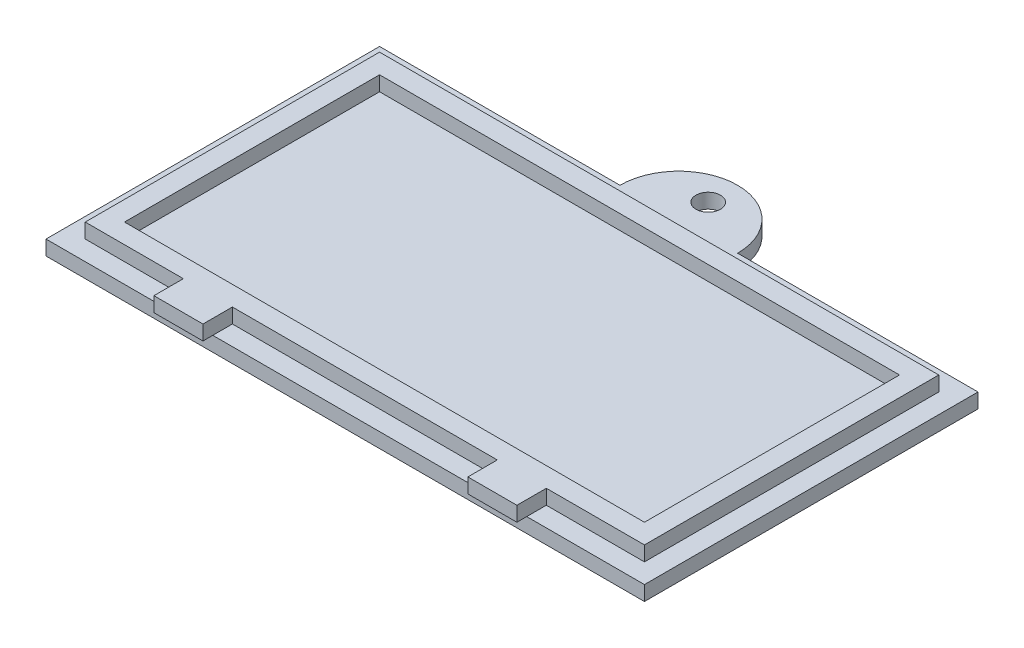
ISO-10303-21;
HEADER;
FILE_DESCRIPTION(('STEP AP214'),'2;1');
FILE_NAME('part.step','',(''),(''),'','','');
FILE_SCHEMA(('AUTOMOTIVE_DESIGN { 1 0 10303 214 1 1 1 1 }'));
ENDSEC;
DATA;
#1=APPLICATION_CONTEXT('core data for automotive mechanical design processes');
#2=APPLICATION_PROTOCOL_DEFINITION('international standard','automotive_design',2000,#1);
#3=PRODUCT_CONTEXT('',#1,'mechanical');
#4=PRODUCT('Part','Part','',(#3));
#5=PRODUCT_RELATED_PRODUCT_CATEGORY('part','',(#4));
#6=PRODUCT_DEFINITION_FORMATION('','',#4);
#7=PRODUCT_DEFINITION_CONTEXT('part definition',#1,'design');
#8=PRODUCT_DEFINITION('design','',#6,#7);
#9=PRODUCT_DEFINITION_SHAPE('','',#8);
#10=(LENGTH_UNIT() NAMED_UNIT(*) SI_UNIT(.MILLI.,.METRE.));
#11=(NAMED_UNIT(*) PLANE_ANGLE_UNIT() SI_UNIT($,.RADIAN.));
#12=(NAMED_UNIT(*) SI_UNIT($,.STERADIAN.) SOLID_ANGLE_UNIT());
#13=UNCERTAINTY_MEASURE_WITH_UNIT(LENGTH_MEASURE(1.E-05),#10,'distance_accuracy_value','');
#14=(GEOMETRIC_REPRESENTATION_CONTEXT(3) GLOBAL_UNCERTAINTY_ASSIGNED_CONTEXT((#13)) GLOBAL_UNIT_ASSIGNED_CONTEXT((#10,
#11,#12)) REPRESENTATION_CONTEXT('',''));
#15=CARTESIAN_POINT('',(0.,0.,0.));
#16=DIRECTION('',(0.,0.,1.));
#17=DIRECTION('',(1.,0.,0.));
#18=AXIS2_PLACEMENT_3D('',#15,#16,#17);
#19=CARTESIAN_POINT('',(0.,1.5,0.));
#20=DIRECTION('',(0.,-1.,0.));
#21=DIRECTION('',(0.,0.,-1.));
#22=AXIS2_PLACEMENT_3D('',#19,#20,#21);
#23=PLANE('',#22);
#24=DIRECTION('',(0.,0.,-1.));
#25=VECTOR('',#24,1.);
#26=CARTESIAN_POINT('',(44.,1.5,1.));
#27=LINE('',#26,#25);
#28=CARTESIAN_POINT('',(44.,1.5,0.));
#29=VERTEX_POINT('',#28);
#30=CARTESIAN_POINT('',(44.,1.5,-2.));
#31=VERTEX_POINT('',#30);
#32=EDGE_CURVE('E427',#29,#31,#27,.T.);
#33=ORIENTED_EDGE('',*,*,#32,.T.);
#34=DIRECTION('',(1.,0.,0.));
#35=VECTOR('',#34,1.);
#36=CARTESIAN_POINT('',(2.,1.5,-2.));
#37=LINE('',#36,#35);
#38=CARTESIAN_POINT('',(17.,1.5,-2.));
#39=VERTEX_POINT('',#38);
#40=EDGE_CURVE('E221',#39,#31,#37,.T.);
#41=ORIENTED_EDGE('',*,*,#40,.F.);
#42=DIRECTION('',(0.,0.,-1.));
#43=VECTOR('',#42,1.);
#44=CARTESIAN_POINT('',(17.,1.5,1.));
#45=LINE('',#44,#43);
#46=CARTESIAN_POINT('',(17.,1.5,0.));
#47=VERTEX_POINT('',#46);
#48=EDGE_CURVE('E428',#47,#39,#45,.T.);
#49=ORIENTED_EDGE('',*,*,#48,.F.);
#50=DIRECTION('',(1.,0.,0.));
#51=VECTOR('',#50,1.);
#52=CARTESIAN_POINT('',(0.,1.5,0.));
#53=LINE('',#52,#51);
#54=EDGE_CURVE('E274',#47,#29,#53,.T.);
#55=ORIENTED_EDGE('',*,*,#54,.T.);
#56=EDGE_LOOP('',(#33,#41,#49,#55));
#57=FACE_BOUND('',#56,.T.);
#58=ADVANCED_FACE('F41',(#57),#23,.F.);
#59=CARTESIAN_POINT('',(30.5,1.5,-37.));
#60=DIRECTION('',(0.,-1.,0.));
#61=DIRECTION('',(0.,0.,-1.));
#62=AXIS2_PLACEMENT_3D('',#59,#60,#61);
#63=CIRCLE('',#62,1.24999999999999);
#64=CARTESIAN_POINT('',(30.5,1.5,-38.25));
#65=VERTEX_POINT('',#64);
#66=EDGE_CURVE('E492',#65,#65,#63,.T.);
#67=ORIENTED_EDGE('',*,*,#66,.T.);
#68=EDGE_LOOP('',(#67));
#69=FACE_BOUND('',#68,.T.);
#70=DIRECTION('',(0.,0.,-1.));
#71=VECTOR('',#70,1.);
#72=CARTESIAN_POINT('',(49.,1.5,1.));
#73=LINE('',#72,#71);
#74=CARTESIAN_POINT('',(49.,1.5,0.));
#75=VERTEX_POINT('',#74);
#76=CARTESIAN_POINT('',(49.,1.5,-2.));
#77=VERTEX_POINT('',#76);
#78=EDGE_CURVE('E417',#75,#77,#73,.T.);
#79=ORIENTED_EDGE('',*,*,#78,.F.);
#80=CARTESIAN_POINT('',(61.,1.5,0.));
#81=VERTEX_POINT('',#80);
#82=EDGE_CURVE('E268',#75,#81,#53,.T.);
#83=ORIENTED_EDGE('',*,*,#82,.T.);
#84=DIRECTION('',(0.,0.,-1.));
#85=VECTOR('',#84,1.);
#86=CARTESIAN_POINT('',(61.,1.5,0.));
#87=LINE('',#86,#85);
#88=CARTESIAN_POINT('',(61.,1.5,-34.));
#89=VERTEX_POINT('',#88);
#90=EDGE_CURVE('E273',#81,#89,#87,.T.);
#91=ORIENTED_EDGE('',*,*,#90,.T.);
#92=DIRECTION('',(-1.,0.,0.));
#93=VECTOR('',#92,1.);
#94=CARTESIAN_POINT('',(0.,1.5,-34.));
#95=LINE('',#94,#93);
#96=CARTESIAN_POINT('',(36.5,1.5,-34.));
#97=VERTEX_POINT('',#96);
#98=EDGE_CURVE('E277',#89,#97,#95,.T.);
#99=ORIENTED_EDGE('',*,*,#98,.T.);
#100=CARTESIAN_POINT('',(30.5,1.5,-34.));
#101=DIRECTION('',(0.,-1.,0.));
#102=DIRECTION('',(0.,0.,-1.));
#103=AXIS2_PLACEMENT_3D('',#100,#101,#102);
#104=CIRCLE('',#103,6.);
#105=CARTESIAN_POINT('',(24.5,1.5,-34.));
#106=VERTEX_POINT('',#105);
#107=EDGE_CURVE('E319',#106,#97,#104,.T.);
#108=ORIENTED_EDGE('',*,*,#107,.F.);
#109=CARTESIAN_POINT('',(0.,1.5,-34.));
#110=VERTEX_POINT('',#109);
#111=EDGE_CURVE('E276',#106,#110,#95,.T.);
#112=ORIENTED_EDGE('',*,*,#111,.T.);
#113=DIRECTION('',(0.,0.,1.));
#114=VECTOR('',#113,1.);
#115=CARTESIAN_POINT('',(0.,1.5,0.));
#116=LINE('',#115,#114);
#117=CARTESIAN_POINT('',(0.,1.5,0.));
#118=VERTEX_POINT('',#117);
#119=EDGE_CURVE('E265',#110,#118,#116,.T.);
#120=ORIENTED_EDGE('',*,*,#119,.T.);
#121=CARTESIAN_POINT('',(12.,1.5,0.));
#122=VERTEX_POINT('',#121);
#123=EDGE_CURVE('E270',#118,#122,#53,.T.);
#124=ORIENTED_EDGE('',*,*,#123,.T.);
#125=DIRECTION('',(0.,0.,-1.));
#126=VECTOR('',#125,1.);
#127=CARTESIAN_POINT('',(12.,1.5,1.));
#128=LINE('',#127,#126);
#129=CARTESIAN_POINT('',(12.,1.5,-2.));
#130=VERTEX_POINT('',#129);
#131=EDGE_CURVE('E438',#122,#130,#128,.T.);
#132=ORIENTED_EDGE('',*,*,#131,.T.);
#133=CARTESIAN_POINT('',(2.,1.5,-2.));
#134=VERTEX_POINT('',#133);
#135=EDGE_CURVE('E245',#134,#130,#37,.T.);
#136=ORIENTED_EDGE('',*,*,#135,.F.);
#137=DIRECTION('',(0.,0.,1.));
#138=VECTOR('',#137,1.);
#139=CARTESIAN_POINT('',(2.,1.5,-32.));
#140=LINE('',#139,#138);
#141=CARTESIAN_POINT('',(2.,1.5,-32.));
#142=VERTEX_POINT('',#141);
#143=EDGE_CURVE('E240',#142,#134,#140,.T.);
#144=ORIENTED_EDGE('',*,*,#143,.F.);
#145=DIRECTION('',(-1.,0.,0.));
#146=VECTOR('',#145,1.);
#147=CARTESIAN_POINT('',(2.,1.5,-32.));
#148=LINE('',#147,#146);
#149=CARTESIAN_POINT('',(59.,1.5,-32.));
#150=VERTEX_POINT('',#149);
#151=EDGE_CURVE('E251',#150,#142,#148,.T.);
#152=ORIENTED_EDGE('',*,*,#151,.F.);
#153=DIRECTION('',(0.,0.,-1.));
#154=VECTOR('',#153,1.);
#155=CARTESIAN_POINT('',(59.,1.5,-32.));
#156=LINE('',#155,#154);
#157=CARTESIAN_POINT('',(59.,1.5,-2.));
#158=VERTEX_POINT('',#157);
#159=EDGE_CURVE('E248',#158,#150,#156,.T.);
#160=ORIENTED_EDGE('',*,*,#159,.F.);
#161=EDGE_CURVE('E243',#77,#158,#37,.T.);
#162=ORIENTED_EDGE('',*,*,#161,.F.);
#163=EDGE_LOOP('',(#79,#83,#91,#99,#108,#112,#120,#124,#132,#136,#144,#152,#160,#162));
#164=FACE_BOUND('',#163,.T.);
#165=ADVANCED_FACE('F385',(#69,#164),#23,.F.);
#166=CARTESIAN_POINT('',(2.,3.,-2.));
#167=DIRECTION('',(0.,0.,-1.));
#168=DIRECTION('',(-1.,0.,0.));
#169=AXIS2_PLACEMENT_3D('',#166,#167,#168);
#170=PLANE('',#169);
#171=DIRECTION('',(0.,-1.,0.));
#172=VECTOR('',#171,1.);
#173=CARTESIAN_POINT('',(44.,3.,-2.));
#174=LINE('',#173,#172);
#175=CARTESIAN_POINT('',(44.,3.,-2.));
#176=VERTEX_POINT('',#175);
#177=EDGE_CURVE('E207',#176,#31,#174,.T.);
#178=ORIENTED_EDGE('',*,*,#177,.F.);
#179=DIRECTION('',(1.,0.,0.));
#180=VECTOR('',#179,1.);
#181=CARTESIAN_POINT('',(2.,3.,-2.));
#182=LINE('',#181,#180);
#183=CARTESIAN_POINT('',(17.,3.,-2.));
#184=VERTEX_POINT('',#183);
#185=EDGE_CURVE('E219',#184,#176,#182,.T.);
#186=ORIENTED_EDGE('',*,*,#185,.F.);
#187=DIRECTION('',(0.,1.,0.));
#188=VECTOR('',#187,1.);
#189=CARTESIAN_POINT('',(17.,3.,-2.));
#190=LINE('',#189,#188);
#191=EDGE_CURVE('E478',#39,#184,#190,.T.);
#192=ORIENTED_EDGE('',*,*,#191,.F.);
#193=ORIENTED_EDGE('',*,*,#40,.T.);
#194=EDGE_LOOP('',(#178,#186,#192,#193));
#195=FACE_BOUND('',#194,.T.);
#196=ADVANCED_FACE('F217',(#195),#170,.F.);
#197=DIRECTION('',(0.,1.,0.));
#198=VECTOR('',#197,1.);
#199=CARTESIAN_POINT('',(49.,3.,-2.));
#200=LINE('',#199,#198);
#201=CARTESIAN_POINT('',(49.,3.,-2.));
#202=VERTEX_POINT('',#201);
#203=EDGE_CURVE('E223',#77,#202,#200,.T.);
#204=ORIENTED_EDGE('',*,*,#203,.F.);
#205=ORIENTED_EDGE('',*,*,#161,.T.);
#206=DIRECTION('',(0.,-1.,0.));
#207=VECTOR('',#206,1.);
#208=CARTESIAN_POINT('',(59.,3.,-2.));
#209=LINE('',#208,#207);
#210=CARTESIAN_POINT('',(59.,3.,-2.));
#211=VERTEX_POINT('',#210);
#212=EDGE_CURVE('E258',#211,#158,#209,.T.);
#213=ORIENTED_EDGE('',*,*,#212,.F.);
#214=EDGE_CURVE('E228',#202,#211,#182,.T.);
#215=ORIENTED_EDGE('',*,*,#214,.F.);
#216=EDGE_LOOP('',(#204,#205,#213,#215));
#217=FACE_BOUND('',#216,.T.);
#218=ADVANCED_FACE('F463',(#217),#170,.F.);
#219=DIRECTION('',(0.,-1.,0.));
#220=VECTOR('',#219,1.);
#221=CARTESIAN_POINT('',(12.,3.,-2.));
#222=LINE('',#221,#220);
#223=CARTESIAN_POINT('',(12.,3.,-2.));
#224=VERTEX_POINT('',#223);
#225=EDGE_CURVE('E222',#224,#130,#222,.T.);
#226=ORIENTED_EDGE('',*,*,#225,.F.);
#227=CARTESIAN_POINT('',(2.,3.,-2.));
#228=VERTEX_POINT('',#227);
#229=EDGE_CURVE('E227',#228,#224,#182,.T.);
#230=ORIENTED_EDGE('',*,*,#229,.F.);
#231=DIRECTION('',(0.,-1.,0.));
#232=VECTOR('',#231,1.);
#233=CARTESIAN_POINT('',(2.,3.,-2.));
#234=LINE('',#233,#232);
#235=EDGE_CURVE('E261',#228,#134,#234,.T.);
#236=ORIENTED_EDGE('',*,*,#235,.T.);
#237=ORIENTED_EDGE('',*,*,#135,.T.);
#238=EDGE_LOOP('',(#226,#230,#236,#237));
#239=FACE_BOUND('',#238,.T.);
#240=ADVANCED_FACE('F446',(#239),#170,.F.);
#241=CARTESIAN_POINT('',(0.,1.5,-34.));
#242=DIRECTION('',(0.,0.,1.));
#243=DIRECTION('',(1.,0.,0.));
#244=AXIS2_PLACEMENT_3D('',#241,#242,#243);
#245=PLANE('',#244);
#246=ORIENTED_EDGE('',*,*,#111,.F.);
#247=DIRECTION('',(0.,-1.,0.));
#248=VECTOR('',#247,1.);
#249=CARTESIAN_POINT('',(24.5,1.5,-34.));
#250=LINE('',#249,#248);
#251=CARTESIAN_POINT('',(24.5,0.,-34.));
#252=VERTEX_POINT('',#251);
#253=EDGE_CURVE('E320',#106,#252,#250,.T.);
#254=ORIENTED_EDGE('',*,*,#253,.T.);
#255=DIRECTION('',(-1.,0.,0.));
#256=VECTOR('',#255,1.);
#257=CARTESIAN_POINT('',(0.,0.,-34.));
#258=LINE('',#257,#256);
#259=CARTESIAN_POINT('',(0.,0.,-34.));
#260=VERTEX_POINT('',#259);
#261=EDGE_CURVE('E287',#252,#260,#258,.T.);
#262=ORIENTED_EDGE('',*,*,#261,.T.);
#263=DIRECTION('',(0.,-1.,0.));
#264=VECTOR('',#263,1.);
#265=CARTESIAN_POINT('',(0.,1.5,-34.));
#266=LINE('',#265,#264);
#267=EDGE_CURVE('E280',#110,#260,#266,.T.);
#268=ORIENTED_EDGE('',*,*,#267,.F.);
#269=EDGE_LOOP('',(#246,#254,#262,#268));
#270=FACE_BOUND('',#269,.T.);
#271=ADVANCED_FACE('F401',(#270),#245,.F.);
#272=CARTESIAN_POINT('',(0.,1.5,0.));
#273=DIRECTION('',(1.,0.,0.));
#274=DIRECTION('',(0.,0.,-1.));
#275=AXIS2_PLACEMENT_3D('',#272,#273,#274);
#276=PLANE('',#275);
#277=DIRECTION('',(0.,0.,1.));
#278=VECTOR('',#277,1.);
#279=CARTESIAN_POINT('',(0.,0.,0.));
#280=LINE('',#279,#278);
#281=CARTESIAN_POINT('',(0.,0.,0.));
#282=VERTEX_POINT('',#281);
#283=EDGE_CURVE('E264',#260,#282,#280,.T.);
#284=ORIENTED_EDGE('',*,*,#283,.T.);
#285=DIRECTION('',(0.,-1.,0.));
#286=VECTOR('',#285,1.);
#287=CARTESIAN_POINT('',(0.,1.5,0.));
#288=LINE('',#287,#286);
#289=EDGE_CURVE('E11',#118,#282,#288,.T.);
#290=ORIENTED_EDGE('',*,*,#289,.F.);
#291=ORIENTED_EDGE('',*,*,#119,.F.);
#292=ORIENTED_EDGE('',*,*,#267,.T.);
#293=EDGE_LOOP('',(#284,#290,#291,#292));
#294=FACE_BOUND('',#293,.T.);
#295=ADVANCED_FACE('F43',(#294),#276,.F.);
#296=CARTESIAN_POINT('',(0.,1.5,0.));
#297=DIRECTION('',(0.,0.,-1.));
#298=DIRECTION('',(-1.,0.,0.));
#299=AXIS2_PLACEMENT_3D('',#296,#297,#298);
#300=PLANE('',#299);
#301=DIRECTION('',(1.,0.,0.));
#302=VECTOR('',#301,1.);
#303=CARTESIAN_POINT('',(0.,0.,0.));
#304=LINE('',#303,#302);
#305=CARTESIAN_POINT('',(61.,0.,0.));
#306=VERTEX_POINT('',#305);
#307=EDGE_CURVE('E283',#282,#306,#304,.T.);
#308=ORIENTED_EDGE('',*,*,#307,.T.);
#309=DIRECTION('',(0.,-1.,0.));
#310=VECTOR('',#309,1.);
#311=CARTESIAN_POINT('',(61.,1.5,0.));
#312=LINE('',#311,#310);
#313=EDGE_CURVE('E49',#81,#306,#312,.T.);
#314=ORIENTED_EDGE('',*,*,#313,.F.);
#315=ORIENTED_EDGE('',*,*,#82,.F.);
#316=EDGE_CURVE('E419',#29,#75,#53,.T.);
#317=ORIENTED_EDGE('',*,*,#316,.F.);
#318=ORIENTED_EDGE('',*,*,#54,.F.);
#319=DIRECTION('',(1.,0.,0.));
#320=VECTOR('',#319,1.);
#321=CARTESIAN_POINT('',(0.,1.5,0.));
#322=LINE('',#321,#320);
#323=EDGE_CURVE('E429',#122,#47,#322,.T.);
#324=ORIENTED_EDGE('',*,*,#323,.F.);
#325=ORIENTED_EDGE('',*,*,#123,.F.);
#326=ORIENTED_EDGE('',*,*,#289,.T.);
#327=EDGE_LOOP('',(#308,#314,#315,#317,#318,#324,#325,#326));
#328=FACE_BOUND('',#327,.T.);
#329=ADVANCED_FACE('F403',(#328),#300,.F.);
#330=CARTESIAN_POINT('',(61.,1.5,0.));
#331=DIRECTION('',(-1.,0.,0.));
#332=DIRECTION('',(0.,0.,1.));
#333=AXIS2_PLACEMENT_3D('',#330,#331,#332);
#334=PLANE('',#333);
#335=DIRECTION('',(0.,0.,-1.));
#336=VECTOR('',#335,1.);
#337=CARTESIAN_POINT('',(61.,0.,0.));
#338=LINE('',#337,#336);
#339=CARTESIAN_POINT('',(61.,0.,-34.));
#340=VERTEX_POINT('',#339);
#341=EDGE_CURVE('E285',#306,#340,#338,.T.);
#342=ORIENTED_EDGE('',*,*,#341,.T.);
#343=DIRECTION('',(0.,-1.,0.));
#344=VECTOR('',#343,1.);
#345=CARTESIAN_POINT('',(61.,1.5,-34.));
#346=LINE('',#345,#344);
#347=EDGE_CURVE('E291',#89,#340,#346,.T.);
#348=ORIENTED_EDGE('',*,*,#347,.F.);
#349=ORIENTED_EDGE('',*,*,#90,.F.);
#350=ORIENTED_EDGE('',*,*,#313,.T.);
#351=EDGE_LOOP('',(#342,#348,#349,#350));
#352=FACE_BOUND('',#351,.T.);
#353=ADVANCED_FACE('F298',(#352),#334,.F.);
#354=CARTESIAN_POINT('',(36.5,0.,-34.));
#355=VERTEX_POINT('',#354);
#356=EDGE_CURVE('E269',#340,#355,#258,.T.);
#357=ORIENTED_EDGE('',*,*,#356,.T.);
#358=DIRECTION('',(0.,-1.,0.));
#359=VECTOR('',#358,1.);
#360=CARTESIAN_POINT('',(36.5,1.5,-34.));
#361=LINE('',#360,#359);
#362=EDGE_CURVE('E313',#355,#97,#361,.F.);
#363=ORIENTED_EDGE('',*,*,#362,.T.);
#364=ORIENTED_EDGE('',*,*,#98,.F.);
#365=ORIENTED_EDGE('',*,*,#347,.T.);
#366=EDGE_LOOP('',(#357,#363,#364,#365));
#367=FACE_BOUND('',#366,.T.);
#368=ADVANCED_FACE('F311',(#367),#245,.F.);
#369=CARTESIAN_POINT('',(0.,0.,0.));
#370=DIRECTION('',(0.,-1.,0.));
#371=DIRECTION('',(0.,0.,-1.));
#372=AXIS2_PLACEMENT_3D('',#369,#370,#371);
#373=PLANE('',#372);
#374=CARTESIAN_POINT('',(30.5,0.,-37.));
#375=DIRECTION('',(0.,-1.,0.));
#376=DIRECTION('',(0.,0.,-1.));
#377=AXIS2_PLACEMENT_3D('',#374,#375,#376);
#378=CIRCLE('',#377,1.24999999999999);
#379=CARTESIAN_POINT('',(30.5,0.,-38.25));
#380=VERTEX_POINT('',#379);
#381=EDGE_CURVE('E434',#380,#380,#378,.T.);
#382=ORIENTED_EDGE('',*,*,#381,.F.);
#383=EDGE_LOOP('',(#382));
#384=FACE_BOUND('',#383,.T.);
#385=ORIENTED_EDGE('',*,*,#261,.F.);
#386=CARTESIAN_POINT('',(30.5,0.,-34.));
#387=DIRECTION('',(0.,-1.,0.));
#388=DIRECTION('',(0.,0.,-1.));
#389=AXIS2_PLACEMENT_3D('',#386,#387,#388);
#390=CIRCLE('',#389,6.);
#391=EDGE_CURVE('E308',#252,#355,#390,.T.);
#392=ORIENTED_EDGE('',*,*,#391,.T.);
#393=ORIENTED_EDGE('',*,*,#356,.F.);
#394=ORIENTED_EDGE('',*,*,#341,.F.);
#395=ORIENTED_EDGE('',*,*,#307,.F.);
#396=ORIENTED_EDGE('',*,*,#283,.F.);
#397=EDGE_LOOP('',(#385,#392,#393,#394,#395,#396));
#398=FACE_BOUND('',#397,.T.);
#399=ADVANCED_FACE('F304',(#384,#398),#373,.T.);
#400=CARTESIAN_POINT('',(2.,3.,-32.));
#401=DIRECTION('',(1.,0.,0.));
#402=DIRECTION('',(0.,0.,-1.));
#403=AXIS2_PLACEMENT_3D('',#400,#401,#402);
#404=PLANE('',#403);
#405=ORIENTED_EDGE('',*,*,#143,.T.);
#406=ORIENTED_EDGE('',*,*,#235,.F.);
#407=DIRECTION('',(0.,0.,1.));
#408=VECTOR('',#407,1.);
#409=CARTESIAN_POINT('',(2.,3.,-32.));
#410=LINE('',#409,#408);
#411=CARTESIAN_POINT('',(2.,3.,-32.));
#412=VERTEX_POINT('',#411);
#413=EDGE_CURVE('E232',#412,#228,#410,.T.);
#414=ORIENTED_EDGE('',*,*,#413,.F.);
#415=DIRECTION('',(0.,-1.,0.));
#416=VECTOR('',#415,1.);
#417=CARTESIAN_POINT('',(2.,3.,-32.));
#418=LINE('',#417,#416);
#419=EDGE_CURVE('E239',#412,#142,#418,.T.);
#420=ORIENTED_EDGE('',*,*,#419,.T.);
#421=EDGE_LOOP('',(#405,#406,#414,#420));
#422=FACE_BOUND('',#421,.T.);
#423=ADVANCED_FACE('F394',(#422),#404,.F.);
#424=CARTESIAN_POINT('',(59.,3.,-32.));
#425=DIRECTION('',(-1.,0.,0.));
#426=DIRECTION('',(0.,0.,1.));
#427=AXIS2_PLACEMENT_3D('',#424,#425,#426);
#428=PLANE('',#427);
#429=ORIENTED_EDGE('',*,*,#159,.T.);
#430=DIRECTION('',(0.,-1.,0.));
#431=VECTOR('',#430,1.);
#432=CARTESIAN_POINT('',(59.,3.,-32.));
#433=LINE('',#432,#431);
#434=CARTESIAN_POINT('',(59.,3.,-32.));
#435=VERTEX_POINT('',#434);
#436=EDGE_CURVE('E255',#435,#150,#433,.T.);
#437=ORIENTED_EDGE('',*,*,#436,.F.);
#438=DIRECTION('',(0.,0.,-1.));
#439=VECTOR('',#438,1.);
#440=CARTESIAN_POINT('',(59.,3.,-32.));
#441=LINE('',#440,#439);
#442=EDGE_CURVE('E231',#211,#435,#441,.T.);
#443=ORIENTED_EDGE('',*,*,#442,.F.);
#444=ORIENTED_EDGE('',*,*,#212,.T.);
#445=EDGE_LOOP('',(#429,#437,#443,#444));
#446=FACE_BOUND('',#445,.T.);
#447=ADVANCED_FACE('F455',(#446),#428,.F.);
#448=CARTESIAN_POINT('',(2.,3.,-32.));
#449=DIRECTION('',(0.,0.,1.));
#450=DIRECTION('',(1.,0.,0.));
#451=AXIS2_PLACEMENT_3D('',#448,#449,#450);
#452=PLANE('',#451);
#453=ORIENTED_EDGE('',*,*,#151,.T.);
#454=ORIENTED_EDGE('',*,*,#419,.F.);
#455=DIRECTION('',(-1.,0.,0.));
#456=VECTOR('',#455,1.);
#457=CARTESIAN_POINT('',(2.,3.,-32.));
#458=LINE('',#457,#456);
#459=EDGE_CURVE('E237',#435,#412,#458,.T.);
#460=ORIENTED_EDGE('',*,*,#459,.F.);
#461=ORIENTED_EDGE('',*,*,#436,.T.);
#462=EDGE_LOOP('',(#453,#454,#460,#461));
#463=FACE_BOUND('',#462,.T.);
#464=ADVANCED_FACE('F459',(#463),#452,.F.);
#465=CARTESIAN_POINT('',(0.,3.,0.));
#466=DIRECTION('',(0.,1.,0.));
#467=DIRECTION('',(0.,0.,1.));
#468=AXIS2_PLACEMENT_3D('',#465,#466,#467);
#469=PLANE('',#468);
#470=DIRECTION('',(0.,0.,1.));
#471=VECTOR('',#470,1.);
#472=CARTESIAN_POINT('',(4.,3.,-30.));
#473=LINE('',#472,#471);
#474=CARTESIAN_POINT('',(4.,3.,-30.));
#475=VERTEX_POINT('',#474);
#476=CARTESIAN_POINT('',(4.,3.,-4.));
#477=VERTEX_POINT('',#476);
#478=EDGE_CURVE('E323',#475,#477,#473,.T.);
#479=ORIENTED_EDGE('',*,*,#478,.F.);
#480=DIRECTION('',(-1.,0.,0.));
#481=VECTOR('',#480,1.);
#482=CARTESIAN_POINT('',(4.,3.,-30.));
#483=LINE('',#482,#481);
#484=CARTESIAN_POINT('',(57.,3.,-30.));
#485=VERTEX_POINT('',#484);
#486=EDGE_CURVE('E332',#485,#475,#483,.T.);
#487=ORIENTED_EDGE('',*,*,#486,.F.);
#488=DIRECTION('',(0.,0.,-1.));
#489=VECTOR('',#488,1.);
#490=CARTESIAN_POINT('',(57.,3.,-30.));
#491=LINE('',#490,#489);
#492=CARTESIAN_POINT('',(57.,3.,-4.));
#493=VERTEX_POINT('',#492);
#494=EDGE_CURVE('E345',#493,#485,#491,.T.);
#495=ORIENTED_EDGE('',*,*,#494,.F.);
#496=DIRECTION('',(1.,0.,0.));
#497=VECTOR('',#496,1.);
#498=CARTESIAN_POINT('',(4.,3.,-4.));
#499=LINE('',#498,#497);
#500=EDGE_CURVE('E342',#477,#493,#499,.T.);
#501=ORIENTED_EDGE('',*,*,#500,.F.);
#502=EDGE_LOOP('',(#479,#487,#495,#501));
#503=FACE_BOUND('',#502,.T.);
#504=ORIENTED_EDGE('',*,*,#413,.T.);
#505=ORIENTED_EDGE('',*,*,#229,.T.);
#506=DIRECTION('',(0.,0.,-1.));
#507=VECTOR('',#506,1.);
#508=CARTESIAN_POINT('',(12.,3.,1.));
#509=LINE('',#508,#507);
#510=CARTESIAN_POINT('',(12.,3.,1.));
#511=VERTEX_POINT('',#510);
#512=EDGE_CURVE('E484',#511,#224,#509,.T.);
#513=ORIENTED_EDGE('',*,*,#512,.F.);
#514=DIRECTION('',(-1.,0.,0.));
#515=VECTOR('',#514,1.);
#516=CARTESIAN_POINT('',(12.,3.,1.));
#517=LINE('',#516,#515);
#518=CARTESIAN_POINT('',(17.,3.,1.));
#519=VERTEX_POINT('',#518);
#520=EDGE_CURVE('E482',#519,#511,#517,.T.);
#521=ORIENTED_EDGE('',*,*,#520,.F.);
#522=DIRECTION('',(0.,0.,-1.));
#523=VECTOR('',#522,1.);
#524=CARTESIAN_POINT('',(17.,3.,1.));
#525=LINE('',#524,#523);
#526=EDGE_CURVE('E63',#519,#184,#525,.T.);
#527=ORIENTED_EDGE('',*,*,#526,.T.);
#528=ORIENTED_EDGE('',*,*,#185,.T.);
#529=DIRECTION('',(0.,0.,-1.));
#530=VECTOR('',#529,1.);
#531=CARTESIAN_POINT('',(44.,3.,1.));
#532=LINE('',#531,#530);
#533=CARTESIAN_POINT('',(44.,3.,1.));
#534=VERTEX_POINT('',#533);
#535=EDGE_CURVE('E204',#534,#176,#532,.T.);
#536=ORIENTED_EDGE('',*,*,#535,.F.);
#537=DIRECTION('',(-1.,0.,0.));
#538=VECTOR('',#537,1.);
#539=CARTESIAN_POINT('',(44.,3.,1.));
#540=LINE('',#539,#538);
#541=CARTESIAN_POINT('',(49.,3.,1.));
#542=VERTEX_POINT('',#541);
#543=EDGE_CURVE('E212',#542,#534,#540,.T.);
#544=ORIENTED_EDGE('',*,*,#543,.F.);
#545=DIRECTION('',(0.,0.,-1.));
#546=VECTOR('',#545,1.);
#547=CARTESIAN_POINT('',(49.,3.,1.));
#548=LINE('',#547,#546);
#549=EDGE_CURVE('E56',#542,#202,#548,.T.);
#550=ORIENTED_EDGE('',*,*,#549,.T.);
#551=ORIENTED_EDGE('',*,*,#214,.T.);
#552=ORIENTED_EDGE('',*,*,#442,.T.);
#553=ORIENTED_EDGE('',*,*,#459,.T.);
#554=EDGE_LOOP('',(#504,#505,#513,#521,#527,#528,#536,#544,#550,#551,#552,#553));
#555=FACE_BOUND('',#554,.T.);
#556=ADVANCED_FACE('F226',(#503,#555),#469,.T.);
#557=CARTESIAN_POINT('',(4.,1.5,-30.));
#558=DIRECTION('',(-1.,0.,0.));
#559=DIRECTION('',(0.,0.,1.));
#560=AXIS2_PLACEMENT_3D('',#557,#558,#559);
#561=PLANE('',#560);
#562=ORIENTED_EDGE('',*,*,#478,.T.);
#563=DIRECTION('',(0.,1.,0.));
#564=VECTOR('',#563,1.);
#565=CARTESIAN_POINT('',(4.,1.5,-4.));
#566=LINE('',#565,#564);
#567=CARTESIAN_POINT('',(4.,1.5,-4.));
#568=VERTEX_POINT('',#567);
#569=EDGE_CURVE('E340',#568,#477,#566,.T.);
#570=ORIENTED_EDGE('',*,*,#569,.F.);
#571=DIRECTION('',(0.,0.,1.));
#572=VECTOR('',#571,1.);
#573=CARTESIAN_POINT('',(4.,1.5,-30.));
#574=LINE('',#573,#572);
#575=CARTESIAN_POINT('',(4.,1.5,-30.));
#576=VERTEX_POINT('',#575);
#577=EDGE_CURVE('E328',#576,#568,#574,.T.);
#578=ORIENTED_EDGE('',*,*,#577,.F.);
#579=DIRECTION('',(0.,1.,0.));
#580=VECTOR('',#579,1.);
#581=CARTESIAN_POINT('',(4.,1.5,-30.));
#582=LINE('',#581,#580);
#583=EDGE_CURVE('E244',#576,#475,#582,.T.);
#584=ORIENTED_EDGE('',*,*,#583,.T.);
#585=EDGE_LOOP('',(#562,#570,#578,#584));
#586=FACE_BOUND('',#585,.T.);
#587=ADVANCED_FACE('F372',(#586),#561,.F.);
#588=CARTESIAN_POINT('',(4.,1.5,-30.));
#589=DIRECTION('',(0.,0.,-1.));
#590=DIRECTION('',(-1.,0.,0.));
#591=AXIS2_PLACEMENT_3D('',#588,#589,#590);
#592=PLANE('',#591);
#593=ORIENTED_EDGE('',*,*,#486,.T.);
#594=ORIENTED_EDGE('',*,*,#583,.F.);
#595=DIRECTION('',(-1.,0.,0.));
#596=VECTOR('',#595,1.);
#597=CARTESIAN_POINT('',(4.,1.5,-30.));
#598=LINE('',#597,#596);
#599=CARTESIAN_POINT('',(57.,1.5,-30.));
#600=VERTEX_POINT('',#599);
#601=EDGE_CURVE('E338',#600,#576,#598,.T.);
#602=ORIENTED_EDGE('',*,*,#601,.F.);
#603=DIRECTION('',(0.,1.,0.));
#604=VECTOR('',#603,1.);
#605=CARTESIAN_POINT('',(57.,1.5,-30.));
#606=LINE('',#605,#604);
#607=EDGE_CURVE('E351',#600,#485,#606,.T.);
#608=ORIENTED_EDGE('',*,*,#607,.T.);
#609=EDGE_LOOP('',(#593,#594,#602,#608));
#610=FACE_BOUND('',#609,.T.);
#611=ADVANCED_FACE('F374',(#610),#592,.F.);
#612=CARTESIAN_POINT('',(57.,1.5,-30.));
#613=DIRECTION('',(1.,0.,0.));
#614=DIRECTION('',(0.,0.,-1.));
#615=AXIS2_PLACEMENT_3D('',#612,#613,#614);
#616=PLANE('',#615);
#617=ORIENTED_EDGE('',*,*,#494,.T.);
#618=ORIENTED_EDGE('',*,*,#607,.F.);
#619=DIRECTION('',(0.,0.,-1.));
#620=VECTOR('',#619,1.);
#621=CARTESIAN_POINT('',(57.,1.5,-30.));
#622=LINE('',#621,#620);
#623=CARTESIAN_POINT('',(57.,1.5,-4.));
#624=VERTEX_POINT('',#623);
#625=EDGE_CURVE('E335',#624,#600,#622,.T.);
#626=ORIENTED_EDGE('',*,*,#625,.F.);
#627=DIRECTION('',(0.,1.,0.));
#628=VECTOR('',#627,1.);
#629=CARTESIAN_POINT('',(57.,1.5,-4.));
#630=LINE('',#629,#628);
#631=EDGE_CURVE('E353',#624,#493,#630,.T.);
#632=ORIENTED_EDGE('',*,*,#631,.T.);
#633=EDGE_LOOP('',(#617,#618,#626,#632));
#634=FACE_BOUND('',#633,.T.);
#635=ADVANCED_FACE('F366',(#634),#616,.F.);
#636=CARTESIAN_POINT('',(4.,1.5,-4.));
#637=DIRECTION('',(0.,0.,1.));
#638=DIRECTION('',(1.,0.,0.));
#639=AXIS2_PLACEMENT_3D('',#636,#637,#638);
#640=PLANE('',#639);
#641=ORIENTED_EDGE('',*,*,#500,.T.);
#642=ORIENTED_EDGE('',*,*,#631,.F.);
#643=DIRECTION('',(1.,0.,0.));
#644=VECTOR('',#643,1.);
#645=CARTESIAN_POINT('',(4.,1.5,-4.));
#646=LINE('',#645,#644);
#647=EDGE_CURVE('E331',#568,#624,#646,.T.);
#648=ORIENTED_EDGE('',*,*,#647,.F.);
#649=ORIENTED_EDGE('',*,*,#569,.T.);
#650=EDGE_LOOP('',(#641,#642,#648,#649));
#651=FACE_BOUND('',#650,.T.);
#652=ADVANCED_FACE('F358',(#651),#640,.F.);
#653=CARTESIAN_POINT('',(0.,1.5,0.));
#654=DIRECTION('',(0.,1.,0.));
#655=DIRECTION('',(0.,0.,1.));
#656=AXIS2_PLACEMENT_3D('',#653,#654,#655);
#657=PLANE('',#656);
#658=ORIENTED_EDGE('',*,*,#601,.T.);
#659=ORIENTED_EDGE('',*,*,#577,.T.);
#660=ORIENTED_EDGE('',*,*,#647,.T.);
#661=ORIENTED_EDGE('',*,*,#625,.T.);
#662=EDGE_LOOP('',(#658,#659,#660,#661));
#663=FACE_BOUND('',#662,.T.);
#664=ADVANCED_FACE('F370',(#663),#657,.T.);
#665=CARTESIAN_POINT('',(30.5,1.5,-34.));
#666=DIRECTION('',(0.,-1.,0.));
#667=DIRECTION('',(0.,0.,-1.));
#668=AXIS2_PLACEMENT_3D('',#665,#666,#667);
#669=CYLINDRICAL_SURFACE('',#668,6.);
#670=ORIENTED_EDGE('',*,*,#253,.F.);
#671=ORIENTED_EDGE('',*,*,#107,.T.);
#672=ORIENTED_EDGE('',*,*,#362,.F.);
#673=ORIENTED_EDGE('',*,*,#391,.F.);
#674=EDGE_LOOP('',(#670,#671,#672,#673));
#675=FACE_BOUND('',#674,.T.);
#676=ADVANCED_FACE('F317',(#675),#669,.T.);
#677=CARTESIAN_POINT('',(30.5,0.,-37.));
#678=DIRECTION('',(0.,-1.,0.));
#679=DIRECTION('',(0.,0.,-1.));
#680=AXIS2_PLACEMENT_3D('',#677,#678,#679);
#681=CYLINDRICAL_SURFACE('',#680,1.24999999999999);
#682=ORIENTED_EDGE('',*,*,#381,.T.);
#683=EDGE_LOOP('',(#682));
#684=FACE_BOUND('',#683,.T.);
#685=ORIENTED_EDGE('',*,*,#66,.F.);
#686=EDGE_LOOP('',(#685));
#687=FACE_BOUND('',#686,.T.);
#688=ADVANCED_FACE('F496',(#684,#687),#681,.F.);
#689=CARTESIAN_POINT('',(12.,1.5,1.));
#690=DIRECTION('',(0.,1.,0.));
#691=DIRECTION('',(0.,0.,1.));
#692=AXIS2_PLACEMENT_3D('',#689,#690,#691);
#693=PLANE('',#692);
#694=CARTESIAN_POINT('',(12.,1.5,1.));
#695=VERTEX_POINT('',#694);
#696=EDGE_CURVE('E435',#695,#122,#128,.T.);
#697=ORIENTED_EDGE('',*,*,#696,.T.);
#698=ORIENTED_EDGE('',*,*,#323,.T.);
#699=CARTESIAN_POINT('',(17.,1.5,1.));
#700=VERTEX_POINT('',#699);
#701=EDGE_CURVE('E442',#700,#47,#45,.T.);
#702=ORIENTED_EDGE('',*,*,#701,.F.);
#703=DIRECTION('',(1.,0.,0.));
#704=VECTOR('',#703,1.);
#705=CARTESIAN_POINT('',(12.,1.5,1.));
#706=LINE('',#705,#704);
#707=EDGE_CURVE('E477',#695,#700,#706,.T.);
#708=ORIENTED_EDGE('',*,*,#707,.F.);
#709=EDGE_LOOP('',(#697,#698,#702,#708));
#710=FACE_BOUND('',#709,.T.);
#711=ADVANCED_FACE('F498',(#710),#693,.F.);
#712=CARTESIAN_POINT('',(12.,3.,1.));
#713=DIRECTION('',(1.,0.,0.));
#714=DIRECTION('',(0.,0.,-1.));
#715=AXIS2_PLACEMENT_3D('',#712,#713,#714);
#716=PLANE('',#715);
#717=ORIENTED_EDGE('',*,*,#225,.T.);
#718=ORIENTED_EDGE('',*,*,#131,.F.);
#719=ORIENTED_EDGE('',*,*,#696,.F.);
#720=DIRECTION('',(0.,-1.,0.));
#721=VECTOR('',#720,1.);
#722=CARTESIAN_POINT('',(12.,3.,1.));
#723=LINE('',#722,#721);
#724=EDGE_CURVE('E474',#511,#695,#723,.T.);
#725=ORIENTED_EDGE('',*,*,#724,.F.);
#726=ORIENTED_EDGE('',*,*,#512,.T.);
#727=EDGE_LOOP('',(#717,#718,#719,#725,#726));
#728=FACE_BOUND('',#727,.T.);
#729=ADVANCED_FACE('F505',(#728),#716,.F.);
#730=CARTESIAN_POINT('',(17.,3.,1.));
#731=DIRECTION('',(-1.,0.,0.));
#732=DIRECTION('',(0.,0.,1.));
#733=AXIS2_PLACEMENT_3D('',#730,#731,#732);
#734=PLANE('',#733);
#735=ORIENTED_EDGE('',*,*,#191,.T.);
#736=ORIENTED_EDGE('',*,*,#526,.F.);
#737=DIRECTION('',(0.,1.,0.));
#738=VECTOR('',#737,1.);
#739=CARTESIAN_POINT('',(17.,3.,1.));
#740=LINE('',#739,#738);
#741=EDGE_CURVE('E480',#700,#519,#740,.T.);
#742=ORIENTED_EDGE('',*,*,#741,.F.);
#743=ORIENTED_EDGE('',*,*,#701,.T.);
#744=ORIENTED_EDGE('',*,*,#48,.T.);
#745=EDGE_LOOP('',(#735,#736,#742,#743,#744));
#746=FACE_BOUND('',#745,.T.);
#747=ADVANCED_FACE('F572',(#746),#734,.F.);
#748=CARTESIAN_POINT('',(0.,0.,1.));
#749=DIRECTION('',(0.,0.,1.));
#750=DIRECTION('',(1.,0.,0.));
#751=AXIS2_PLACEMENT_3D('',#748,#749,#750);
#752=PLANE('',#751);
#753=ORIENTED_EDGE('',*,*,#724,.T.);
#754=ORIENTED_EDGE('',*,*,#707,.T.);
#755=ORIENTED_EDGE('',*,*,#741,.T.);
#756=ORIENTED_EDGE('',*,*,#520,.T.);
#757=EDGE_LOOP('',(#753,#754,#755,#756));
#758=FACE_BOUND('',#757,.T.);
#759=ADVANCED_FACE('F581',(#758),#752,.T.);
#760=CARTESIAN_POINT('',(44.,1.5,1.));
#761=DIRECTION('',(0.,1.,0.));
#762=DIRECTION('',(0.,0.,1.));
#763=AXIS2_PLACEMENT_3D('',#760,#761,#762);
#764=PLANE('',#763);
#765=CARTESIAN_POINT('',(44.,1.5,1.));
#766=VERTEX_POINT('',#765);
#767=EDGE_CURVE('E799',#766,#29,#27,.T.);
#768=ORIENTED_EDGE('',*,*,#767,.T.);
#769=ORIENTED_EDGE('',*,*,#316,.T.);
#770=CARTESIAN_POINT('',(49.,1.5,1.));
#771=VERTEX_POINT('',#770);
#772=EDGE_CURVE('E801',#771,#75,#73,.T.);
#773=ORIENTED_EDGE('',*,*,#772,.F.);
#774=DIRECTION('',(1.,0.,0.));
#775=VECTOR('',#774,1.);
#776=CARTESIAN_POINT('',(44.,1.5,1.));
#777=LINE('',#776,#775);
#778=EDGE_CURVE('E466',#766,#771,#777,.T.);
#779=ORIENTED_EDGE('',*,*,#778,.F.);
#780=EDGE_LOOP('',(#768,#769,#773,#779));
#781=FACE_BOUND('',#780,.T.);
#782=ADVANCED_FACE('F592',(#781),#764,.F.);
#783=CARTESIAN_POINT('',(44.,3.,1.));
#784=DIRECTION('',(1.,0.,0.));
#785=DIRECTION('',(0.,0.,-1.));
#786=AXIS2_PLACEMENT_3D('',#783,#784,#785);
#787=PLANE('',#786);
#788=ORIENTED_EDGE('',*,*,#177,.T.);
#789=ORIENTED_EDGE('',*,*,#32,.F.);
#790=ORIENTED_EDGE('',*,*,#767,.F.);
#791=DIRECTION('',(0.,-1.,0.));
#792=VECTOR('',#791,1.);
#793=CARTESIAN_POINT('',(44.,3.,1.));
#794=LINE('',#793,#792);
#795=EDGE_CURVE('E211',#534,#766,#794,.T.);
#796=ORIENTED_EDGE('',*,*,#795,.F.);
#797=ORIENTED_EDGE('',*,*,#535,.T.);
#798=EDGE_LOOP('',(#788,#789,#790,#796,#797));
#799=FACE_BOUND('',#798,.T.);
#800=ADVANCED_FACE('F206',(#799),#787,.F.);
#801=CARTESIAN_POINT('',(49.,3.,1.));
#802=DIRECTION('',(-1.,0.,0.));
#803=DIRECTION('',(0.,0.,1.));
#804=AXIS2_PLACEMENT_3D('',#801,#802,#803);
#805=PLANE('',#804);
#806=ORIENTED_EDGE('',*,*,#203,.T.);
#807=ORIENTED_EDGE('',*,*,#549,.F.);
#808=DIRECTION('',(0.,1.,0.));
#809=VECTOR('',#808,1.);
#810=CARTESIAN_POINT('',(49.,3.,1.));
#811=LINE('',#810,#809);
#812=EDGE_CURVE('E471',#771,#542,#811,.T.);
#813=ORIENTED_EDGE('',*,*,#812,.F.);
#814=ORIENTED_EDGE('',*,*,#772,.T.);
#815=ORIENTED_EDGE('',*,*,#78,.T.);
#816=EDGE_LOOP('',(#806,#807,#813,#814,#815));
#817=FACE_BOUND('',#816,.T.);
#818=ADVANCED_FACE('F612',(#817),#805,.F.);
#819=CARTESIAN_POINT('',(0.,0.,1.));
#820=DIRECTION('',(0.,0.,1.));
#821=DIRECTION('',(1.,0.,0.));
#822=AXIS2_PLACEMENT_3D('',#819,#820,#821);
#823=PLANE('',#822);
#824=ORIENTED_EDGE('',*,*,#795,.T.);
#825=ORIENTED_EDGE('',*,*,#778,.T.);
#826=ORIENTED_EDGE('',*,*,#812,.T.);
#827=ORIENTED_EDGE('',*,*,#543,.T.);
#828=EDGE_LOOP('',(#824,#825,#826,#827));
#829=FACE_BOUND('',#828,.T.);
#830=ADVANCED_FACE('F622',(#829),#823,.T.);
#831=CLOSED_SHELL('',(#58,#165,#196,#218,#240,#271,#295,#329,#353,#368,#399,#423,#447,#464,#556,
#587,#611,#635,#652,#664,#676,#688,#711,#729,#747,#759,#782,#800,#818,#830));
#832=MANIFOLD_SOLID_BREP('B2',#831);
#833=ADVANCED_BREP_SHAPE_REPRESENTATION('',(#18,#832),#14);
#834=SHAPE_DEFINITION_REPRESENTATION(#9,#833);
ENDSEC;
END-ISO-10303-21;
